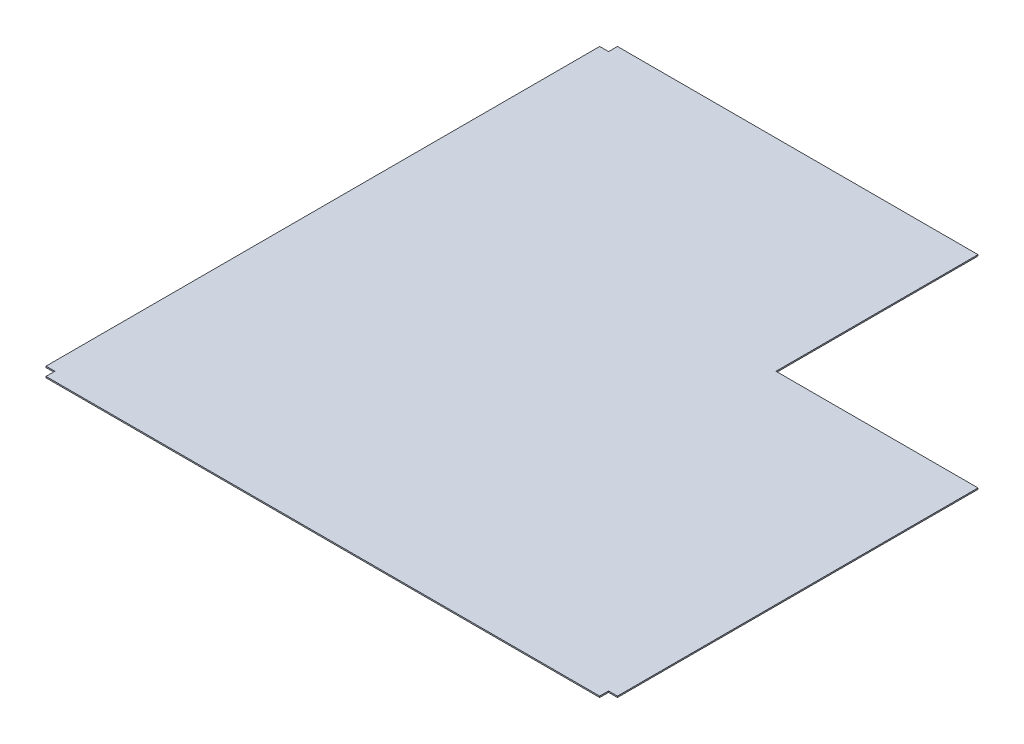
ISO-10303-21;
HEADER;
FILE_DESCRIPTION(('STEP AP214'),'2;1');
FILE_NAME('part.step','',(''),(''),'','','');
FILE_SCHEMA(('AUTOMOTIVE_DESIGN { 1 0 10303 214 1 1 1 1 }'));
ENDSEC;
DATA;
#1=APPLICATION_CONTEXT('core data for automotive mechanical design processes');
#2=APPLICATION_PROTOCOL_DEFINITION('international standard','automotive_design',2000,#1);
#3=PRODUCT_CONTEXT('',#1,'mechanical');
#4=PRODUCT('Part','Part','',(#3));
#5=PRODUCT_RELATED_PRODUCT_CATEGORY('part','',(#4));
#6=PRODUCT_DEFINITION_FORMATION('','',#4);
#7=PRODUCT_DEFINITION_CONTEXT('part definition',#1,'design');
#8=PRODUCT_DEFINITION('design','',#6,#7);
#9=PRODUCT_DEFINITION_SHAPE('','',#8);
#10=(LENGTH_UNIT() NAMED_UNIT(*) SI_UNIT(.MILLI.,.METRE.));
#11=(NAMED_UNIT(*) PLANE_ANGLE_UNIT() SI_UNIT($,.RADIAN.));
#12=(NAMED_UNIT(*) SI_UNIT($,.STERADIAN.) SOLID_ANGLE_UNIT());
#13=UNCERTAINTY_MEASURE_WITH_UNIT(LENGTH_MEASURE(1.E-05),#10,'distance_accuracy_value','');
#14=(GEOMETRIC_REPRESENTATION_CONTEXT(3) GLOBAL_UNCERTAINTY_ASSIGNED_CONTEXT((#13)) GLOBAL_UNIT_ASSIGNED_CONTEXT((#10,
#11,#12)) REPRESENTATION_CONTEXT('',''));
#15=CARTESIAN_POINT('',(0.,0.,0.));
#16=DIRECTION('',(0.,0.,1.));
#17=DIRECTION('',(1.,0.,0.));
#18=AXIS2_PLACEMENT_3D('',#15,#16,#17);
#19=CARTESIAN_POINT('',(280.,1.,0.));
#20=DIRECTION('',(0.,0.,1.));
#21=DIRECTION('',(1.,0.,0.));
#22=AXIS2_PLACEMENT_3D('',#19,#20,#21);
#23=PLANE('',#22);
#24=DIRECTION('',(-1.,0.,0.));
#25=VECTOR('',#24,1.);
#26=CARTESIAN_POINT('',(280.,0.,0.));
#27=LINE('',#26,#25);
#28=CARTESIAN_POINT('',(280.,0.,0.));
#29=VERTEX_POINT('',#28);
#30=CARTESIAN_POINT('',(0.,0.,0.));
#31=VERTEX_POINT('',#30);
#32=EDGE_CURVE('E157',#29,#31,#27,.T.);
#33=ORIENTED_EDGE('',*,*,#32,.T.);
#34=DIRECTION('',(0.,-1.,0.));
#35=VECTOR('',#34,1.);
#36=CARTESIAN_POINT('',(0.,1.,0.));
#37=LINE('',#36,#35);
#38=CARTESIAN_POINT('',(0.,1.,0.));
#39=VERTEX_POINT('',#38);
#40=EDGE_CURVE('E11',#39,#31,#37,.T.);
#41=ORIENTED_EDGE('',*,*,#40,.F.);
#42=DIRECTION('',(-1.,0.,0.));
#43=VECTOR('',#42,1.);
#44=CARTESIAN_POINT('',(280.,1.,0.));
#45=LINE('',#44,#43);
#46=CARTESIAN_POINT('',(280.,1.,0.));
#47=VERTEX_POINT('',#46);
#48=EDGE_CURVE('E179',#47,#39,#45,.T.);
#49=ORIENTED_EDGE('',*,*,#48,.F.);
#50=DIRECTION('',(0.,-1.,0.));
#51=VECTOR('',#50,1.);
#52=CARTESIAN_POINT('',(280.,1.,0.));
#53=LINE('',#52,#51);
#54=EDGE_CURVE('E153',#47,#29,#53,.T.);
#55=ORIENTED_EDGE('',*,*,#54,.T.);
#56=EDGE_LOOP('',(#33,#41,#49,#55));
#57=FACE_BOUND('',#56,.T.);
#58=ADVANCED_FACE('F37',(#57),#23,.F.);
#59=CARTESIAN_POINT('',(0.,1.,0.));
#60=DIRECTION('',(1.,0.,0.));
#61=DIRECTION('',(0.,0.,-1.));
#62=AXIS2_PLACEMENT_3D('',#59,#60,#61);
#63=PLANE('',#62);
#64=DIRECTION('',(0.,0.,1.));
#65=VECTOR('',#64,1.);
#66=CARTESIAN_POINT('',(0.,0.,0.));
#67=LINE('',#66,#65);
#68=CARTESIAN_POINT('',(0.,0.,6.9));
#69=VERTEX_POINT('',#68);
#70=EDGE_CURVE('E160',#31,#69,#67,.T.);
#71=ORIENTED_EDGE('',*,*,#70,.T.);
#72=DIRECTION('',(0.,-1.,0.));
#73=VECTOR('',#72,1.);
#74=CARTESIAN_POINT('',(0.,1.,6.9));
#75=LINE('',#74,#73);
#76=CARTESIAN_POINT('',(0.,1.,6.9));
#77=VERTEX_POINT('',#76);
#78=EDGE_CURVE('E45',#77,#69,#75,.T.);
#79=ORIENTED_EDGE('',*,*,#78,.F.);
#80=DIRECTION('',(0.,0.,1.));
#81=VECTOR('',#80,1.);
#82=CARTESIAN_POINT('',(0.,1.,0.));
#83=LINE('',#82,#81);
#84=EDGE_CURVE('E108',#39,#77,#83,.T.);
#85=ORIENTED_EDGE('',*,*,#84,.F.);
#86=ORIENTED_EDGE('',*,*,#40,.T.);
#87=EDGE_LOOP('',(#71,#79,#85,#86));
#88=FACE_BOUND('',#87,.T.);
#89=ADVANCED_FACE('F257',(#88),#63,.F.);
#90=CARTESIAN_POINT('',(0.,1.,6.9));
#91=DIRECTION('',(0.,0.,1.));
#92=DIRECTION('',(1.,0.,0.));
#93=AXIS2_PLACEMENT_3D('',#90,#91,#92);
#94=PLANE('',#93);
#95=DIRECTION('',(-1.,0.,0.));
#96=VECTOR('',#95,1.);
#97=CARTESIAN_POINT('',(0.,0.,6.9));
#98=LINE('',#97,#96);
#99=CARTESIAN_POINT('',(-6.9,0.,6.9));
#100=VERTEX_POINT('',#99);
#101=EDGE_CURVE('E162',#69,#100,#98,.T.);
#102=ORIENTED_EDGE('',*,*,#101,.T.);
#103=DIRECTION('',(0.,-1.,0.));
#104=VECTOR('',#103,1.);
#105=CARTESIAN_POINT('',(-6.9,1.,6.9));
#106=LINE('',#105,#104);
#107=CARTESIAN_POINT('',(-6.9,1.,6.9));
#108=VERTEX_POINT('',#107);
#109=EDGE_CURVE('E198',#108,#100,#106,.T.);
#110=ORIENTED_EDGE('',*,*,#109,.F.);
#111=DIRECTION('',(-1.,0.,0.));
#112=VECTOR('',#111,1.);
#113=CARTESIAN_POINT('',(0.,1.,6.9));
#114=LINE('',#113,#112);
#115=EDGE_CURVE('E206',#77,#108,#114,.T.);
#116=ORIENTED_EDGE('',*,*,#115,.F.);
#117=ORIENTED_EDGE('',*,*,#78,.T.);
#118=EDGE_LOOP('',(#102,#110,#116,#117));
#119=FACE_BOUND('',#118,.T.);
#120=ADVANCED_FACE('F204',(#119),#94,.F.);
#121=CARTESIAN_POINT('',(-6.9,1.,6.9));
#122=DIRECTION('',(1.,0.,0.));
#123=DIRECTION('',(0.,0.,-1.));
#124=AXIS2_PLACEMENT_3D('',#121,#122,#123);
#125=PLANE('',#124);
#126=DIRECTION('',(0.,0.,1.));
#127=VECTOR('',#126,1.);
#128=CARTESIAN_POINT('',(-6.9,0.,6.9));
#129=LINE('',#128,#127);
#130=CARTESIAN_POINT('',(-6.89999999999995,0.,436.9));
#131=VERTEX_POINT('',#130);
#132=EDGE_CURVE('E164',#100,#131,#129,.T.);
#133=ORIENTED_EDGE('',*,*,#132,.T.);
#134=DIRECTION('',(0.,-1.,0.));
#135=VECTOR('',#134,1.);
#136=CARTESIAN_POINT('',(-6.89999999999995,1.,436.9));
#137=LINE('',#136,#135);
#138=CARTESIAN_POINT('',(-6.89999999999995,1.,436.9));
#139=VERTEX_POINT('',#138);
#140=EDGE_CURVE('E195',#139,#131,#137,.T.);
#141=ORIENTED_EDGE('',*,*,#140,.F.);
#142=DIRECTION('',(0.,0.,1.));
#143=VECTOR('',#142,1.);
#144=CARTESIAN_POINT('',(-6.9,1.,6.9));
#145=LINE('',#144,#143);
#146=EDGE_CURVE('E224',#108,#139,#145,.T.);
#147=ORIENTED_EDGE('',*,*,#146,.F.);
#148=ORIENTED_EDGE('',*,*,#109,.T.);
#149=EDGE_LOOP('',(#133,#141,#147,#148));
#150=FACE_BOUND('',#149,.T.);
#151=ADVANCED_FACE('F215',(#150),#125,.F.);
#152=CARTESIAN_POINT('',(-6.89999999999995,1.,436.9));
#153=DIRECTION('',(0.,0.,-1.));
#154=DIRECTION('',(-1.,0.,0.));
#155=AXIS2_PLACEMENT_3D('',#152,#153,#154);
#156=PLANE('',#155);
#157=DIRECTION('',(1.,0.,0.));
#158=VECTOR('',#157,1.);
#159=CARTESIAN_POINT('',(-6.89999999999995,0.,436.9));
#160=LINE('',#159,#158);
#161=CARTESIAN_POINT('',(0.,0.,436.9));
#162=VERTEX_POINT('',#161);
#163=EDGE_CURVE('E166',#131,#162,#160,.T.);
#164=ORIENTED_EDGE('',*,*,#163,.T.);
#165=DIRECTION('',(0.,-1.,0.));
#166=VECTOR('',#165,1.);
#167=CARTESIAN_POINT('',(0.,1.,436.9));
#168=LINE('',#167,#166);
#169=CARTESIAN_POINT('',(0.,1.,436.9));
#170=VERTEX_POINT('',#169);
#171=EDGE_CURVE('E192',#170,#162,#168,.T.);
#172=ORIENTED_EDGE('',*,*,#171,.F.);
#173=DIRECTION('',(1.,0.,0.));
#174=VECTOR('',#173,1.);
#175=CARTESIAN_POINT('',(-6.89999999999995,1.,436.9));
#176=LINE('',#175,#174);
#177=EDGE_CURVE('E221',#139,#170,#176,.T.);
#178=ORIENTED_EDGE('',*,*,#177,.F.);
#179=ORIENTED_EDGE('',*,*,#140,.T.);
#180=EDGE_LOOP('',(#164,#172,#178,#179));
#181=FACE_BOUND('',#180,.T.);
#182=ADVANCED_FACE('F219',(#181),#156,.F.);
#183=CARTESIAN_POINT('',(0.,1.,436.9));
#184=DIRECTION('',(1.,0.,0.));
#185=DIRECTION('',(0.,0.,-1.));
#186=AXIS2_PLACEMENT_3D('',#183,#184,#185);
#187=PLANE('',#186);
#188=DIRECTION('',(0.,0.,1.));
#189=VECTOR('',#188,1.);
#190=CARTESIAN_POINT('',(0.,0.,436.9));
#191=LINE('',#190,#189);
#192=CARTESIAN_POINT('',(0.,0.,443.8));
#193=VERTEX_POINT('',#192);
#194=EDGE_CURVE('E168',#162,#193,#191,.T.);
#195=ORIENTED_EDGE('',*,*,#194,.T.);
#196=DIRECTION('',(0.,-1.,0.));
#197=VECTOR('',#196,1.);
#198=CARTESIAN_POINT('',(0.,1.,443.8));
#199=LINE('',#198,#197);
#200=CARTESIAN_POINT('',(0.,1.,443.8));
#201=VERTEX_POINT('',#200);
#202=EDGE_CURVE('E189',#201,#193,#199,.T.);
#203=ORIENTED_EDGE('',*,*,#202,.F.);
#204=DIRECTION('',(0.,0.,1.));
#205=VECTOR('',#204,1.);
#206=CARTESIAN_POINT('',(0.,1.,436.9));
#207=LINE('',#206,#205);
#208=EDGE_CURVE('E223',#170,#201,#207,.T.);
#209=ORIENTED_EDGE('',*,*,#208,.F.);
#210=ORIENTED_EDGE('',*,*,#171,.T.);
#211=EDGE_LOOP('',(#195,#203,#209,#210));
#212=FACE_BOUND('',#211,.T.);
#213=ADVANCED_FACE('F270',(#212),#187,.F.);
#214=CARTESIAN_POINT('',(0.,1.,443.8));
#215=DIRECTION('',(0.,0.,-1.));
#216=DIRECTION('',(-1.,0.,0.));
#217=AXIS2_PLACEMENT_3D('',#214,#215,#216);
#218=PLANE('',#217);
#219=DIRECTION('',(1.,0.,0.));
#220=VECTOR('',#219,1.);
#221=CARTESIAN_POINT('',(0.,0.,443.8));
#222=LINE('',#221,#220);
#223=CARTESIAN_POINT('',(430.,0.,443.8));
#224=VERTEX_POINT('',#223);
#225=EDGE_CURVE('E170',#193,#224,#222,.T.);
#226=ORIENTED_EDGE('',*,*,#225,.T.);
#227=DIRECTION('',(0.,-1.,0.));
#228=VECTOR('',#227,1.);
#229=CARTESIAN_POINT('',(430.,1.,443.8));
#230=LINE('',#229,#228);
#231=CARTESIAN_POINT('',(430.,1.,443.8));
#232=VERTEX_POINT('',#231);
#233=EDGE_CURVE('E186',#232,#224,#230,.T.);
#234=ORIENTED_EDGE('',*,*,#233,.F.);
#235=DIRECTION('',(1.,0.,0.));
#236=VECTOR('',#235,1.);
#237=CARTESIAN_POINT('',(0.,1.,443.8));
#238=LINE('',#237,#236);
#239=EDGE_CURVE('E226',#201,#232,#238,.T.);
#240=ORIENTED_EDGE('',*,*,#239,.F.);
#241=ORIENTED_EDGE('',*,*,#202,.T.);
#242=EDGE_LOOP('',(#226,#234,#240,#241));
#243=FACE_BOUND('',#242,.T.);
#244=ADVANCED_FACE('F273',(#243),#218,.F.);
#245=CARTESIAN_POINT('',(430.,1.,443.8));
#246=DIRECTION('',(-1.,0.,0.));
#247=DIRECTION('',(0.,0.,1.));
#248=AXIS2_PLACEMENT_3D('',#245,#246,#247);
#249=PLANE('',#248);
#250=DIRECTION('',(0.,0.,-1.));
#251=VECTOR('',#250,1.);
#252=CARTESIAN_POINT('',(430.,0.,443.8));
#253=LINE('',#252,#251);
#254=CARTESIAN_POINT('',(430.,0.,436.9));
#255=VERTEX_POINT('',#254);
#256=EDGE_CURVE('E172',#224,#255,#253,.T.);
#257=ORIENTED_EDGE('',*,*,#256,.T.);
#258=DIRECTION('',(0.,-1.,0.));
#259=VECTOR('',#258,1.);
#260=CARTESIAN_POINT('',(430.,1.,436.9));
#261=LINE('',#260,#259);
#262=CARTESIAN_POINT('',(430.,1.,436.9));
#263=VERTEX_POINT('',#262);
#264=EDGE_CURVE('E183',#263,#255,#261,.T.);
#265=ORIENTED_EDGE('',*,*,#264,.F.);
#266=DIRECTION('',(0.,0.,-1.));
#267=VECTOR('',#266,1.);
#268=CARTESIAN_POINT('',(430.,1.,443.8));
#269=LINE('',#268,#267);
#270=EDGE_CURVE('E232',#232,#263,#269,.T.);
#271=ORIENTED_EDGE('',*,*,#270,.F.);
#272=ORIENTED_EDGE('',*,*,#233,.T.);
#273=EDGE_LOOP('',(#257,#265,#271,#272));
#274=FACE_BOUND('',#273,.T.);
#275=ADVANCED_FACE('F238',(#274),#249,.F.);
#276=CARTESIAN_POINT('',(430.,1.,436.9));
#277=DIRECTION('',(0.,0.,-1.));
#278=DIRECTION('',(-1.,0.,0.));
#279=AXIS2_PLACEMENT_3D('',#276,#277,#278);
#280=PLANE('',#279);
#281=DIRECTION('',(1.,0.,0.));
#282=VECTOR('',#281,1.);
#283=CARTESIAN_POINT('',(430.,0.,436.9));
#284=LINE('',#283,#282);
#285=CARTESIAN_POINT('',(436.9,0.,436.9));
#286=VERTEX_POINT('',#285);
#287=EDGE_CURVE('E174',#255,#286,#284,.T.);
#288=ORIENTED_EDGE('',*,*,#287,.T.);
#289=DIRECTION('',(0.,-1.,0.));
#290=VECTOR('',#289,1.);
#291=CARTESIAN_POINT('',(436.9,1.,436.9));
#292=LINE('',#291,#290);
#293=CARTESIAN_POINT('',(436.9,1.,436.9));
#294=VERTEX_POINT('',#293);
#295=EDGE_CURVE('E148',#294,#286,#292,.T.);
#296=ORIENTED_EDGE('',*,*,#295,.F.);
#297=DIRECTION('',(1.,0.,0.));
#298=VECTOR('',#297,1.);
#299=CARTESIAN_POINT('',(430.,1.,436.9));
#300=LINE('',#299,#298);
#301=EDGE_CURVE('E139',#263,#294,#300,.T.);
#302=ORIENTED_EDGE('',*,*,#301,.F.);
#303=ORIENTED_EDGE('',*,*,#264,.T.);
#304=EDGE_LOOP('',(#288,#296,#302,#303));
#305=FACE_BOUND('',#304,.T.);
#306=ADVANCED_FACE('F242',(#305),#280,.F.);
#307=CARTESIAN_POINT('',(436.9,1.,436.9));
#308=DIRECTION('',(-1.,0.,0.));
#309=DIRECTION('',(0.,0.,1.));
#310=AXIS2_PLACEMENT_3D('',#307,#308,#309);
#311=PLANE('',#310);
#312=DIRECTION('',(0.,0.,-1.));
#313=VECTOR('',#312,1.);
#314=CARTESIAN_POINT('',(436.9,0.,436.9));
#315=LINE('',#314,#313);
#316=CARTESIAN_POINT('',(436.9,0.,156.9));
#317=VERTEX_POINT('',#316);
#318=EDGE_CURVE('E147',#286,#317,#315,.T.);
#319=ORIENTED_EDGE('',*,*,#318,.T.);
#320=DIRECTION('',(0.,-1.,0.));
#321=VECTOR('',#320,1.);
#322=CARTESIAN_POINT('',(436.9,1.,156.9));
#323=LINE('',#322,#321);
#324=CARTESIAN_POINT('',(436.9,1.,156.9));
#325=VERTEX_POINT('',#324);
#326=EDGE_CURVE('E144',#325,#317,#323,.T.);
#327=ORIENTED_EDGE('',*,*,#326,.F.);
#328=DIRECTION('',(0.,0.,-1.));
#329=VECTOR('',#328,1.);
#330=CARTESIAN_POINT('',(436.9,1.,436.9));
#331=LINE('',#330,#329);
#332=EDGE_CURVE('E133',#294,#325,#331,.T.);
#333=ORIENTED_EDGE('',*,*,#332,.F.);
#334=ORIENTED_EDGE('',*,*,#295,.T.);
#335=EDGE_LOOP('',(#319,#327,#333,#334));
#336=FACE_BOUND('',#335,.T.);
#337=ADVANCED_FACE('F145',(#336),#311,.F.);
#338=CARTESIAN_POINT('',(436.9,1.,156.9));
#339=DIRECTION('',(0.,0.,1.));
#340=DIRECTION('',(1.,0.,0.));
#341=AXIS2_PLACEMENT_3D('',#338,#339,#340);
#342=PLANE('',#341);
#343=DIRECTION('',(-1.,0.,0.));
#344=VECTOR('',#343,1.);
#345=CARTESIAN_POINT('',(436.9,0.,156.9));
#346=LINE('',#345,#344);
#347=CARTESIAN_POINT('',(280.,0.,156.9));
#348=VERTEX_POINT('',#347);
#349=EDGE_CURVE('E94',#317,#348,#346,.T.);
#350=ORIENTED_EDGE('',*,*,#349,.T.);
#351=DIRECTION('',(0.,-1.,0.));
#352=VECTOR('',#351,1.);
#353=CARTESIAN_POINT('',(280.,1.,156.9));
#354=LINE('',#353,#352);
#355=CARTESIAN_POINT('',(280.,1.,156.9));
#356=VERTEX_POINT('',#355);
#357=EDGE_CURVE('E149',#356,#348,#354,.T.);
#358=ORIENTED_EDGE('',*,*,#357,.F.);
#359=DIRECTION('',(-1.,0.,0.));
#360=VECTOR('',#359,1.);
#361=CARTESIAN_POINT('',(436.9,1.,156.9));
#362=LINE('',#361,#360);
#363=EDGE_CURVE('E137',#325,#356,#362,.T.);
#364=ORIENTED_EDGE('',*,*,#363,.F.);
#365=ORIENTED_EDGE('',*,*,#326,.T.);
#366=EDGE_LOOP('',(#350,#358,#364,#365));
#367=FACE_BOUND('',#366,.T.);
#368=ADVANCED_FACE('F151',(#367),#342,.F.);
#369=CARTESIAN_POINT('',(280.,1.,156.9));
#370=DIRECTION('',(-1.,0.,0.));
#371=DIRECTION('',(0.,0.,1.));
#372=AXIS2_PLACEMENT_3D('',#369,#370,#371);
#373=PLANE('',#372);
#374=DIRECTION('',(0.,0.,-1.));
#375=VECTOR('',#374,1.);
#376=CARTESIAN_POINT('',(280.,0.,156.9));
#377=LINE('',#376,#375);
#378=EDGE_CURVE('E100',#348,#29,#377,.T.);
#379=ORIENTED_EDGE('',*,*,#378,.T.);
#380=ORIENTED_EDGE('',*,*,#54,.F.);
#381=DIRECTION('',(0.,0.,-1.));
#382=VECTOR('',#381,1.);
#383=CARTESIAN_POINT('',(280.,1.,156.9));
#384=LINE('',#383,#382);
#385=EDGE_CURVE('E53',#356,#47,#384,.T.);
#386=ORIENTED_EDGE('',*,*,#385,.F.);
#387=ORIENTED_EDGE('',*,*,#357,.T.);
#388=EDGE_LOOP('',(#379,#380,#386,#387));
#389=FACE_BOUND('',#388,.T.);
#390=ADVANCED_FACE('F246',(#389),#373,.F.);
#391=CARTESIAN_POINT('',(0.,1.,0.));
#392=DIRECTION('',(0.,1.,0.));
#393=DIRECTION('',(0.,0.,1.));
#394=AXIS2_PLACEMENT_3D('',#391,#392,#393);
#395=PLANE('',#394);
#396=ORIENTED_EDGE('',*,*,#48,.T.);
#397=ORIENTED_EDGE('',*,*,#84,.T.);
#398=ORIENTED_EDGE('',*,*,#115,.T.);
#399=ORIENTED_EDGE('',*,*,#146,.T.);
#400=ORIENTED_EDGE('',*,*,#177,.T.);
#401=ORIENTED_EDGE('',*,*,#208,.T.);
#402=ORIENTED_EDGE('',*,*,#239,.T.);
#403=ORIENTED_EDGE('',*,*,#270,.T.);
#404=ORIENTED_EDGE('',*,*,#301,.T.);
#405=ORIENTED_EDGE('',*,*,#332,.T.);
#406=ORIENTED_EDGE('',*,*,#363,.T.);
#407=ORIENTED_EDGE('',*,*,#385,.T.);
#408=EDGE_LOOP('',(#396,#397,#398,#399,#400,#401,#402,#403,#404,#405,#406,#407));
#409=FACE_BOUND('',#408,.T.);
#410=ADVANCED_FACE('F135',(#409),#395,.T.);
#411=CARTESIAN_POINT('',(0.,0.,0.));
#412=DIRECTION('',(0.,1.,0.));
#413=DIRECTION('',(0.,0.,1.));
#414=AXIS2_PLACEMENT_3D('',#411,#412,#413);
#415=PLANE('',#414);
#416=ORIENTED_EDGE('',*,*,#32,.F.);
#417=ORIENTED_EDGE('',*,*,#378,.F.);
#418=ORIENTED_EDGE('',*,*,#349,.F.);
#419=ORIENTED_EDGE('',*,*,#318,.F.);
#420=ORIENTED_EDGE('',*,*,#287,.F.);
#421=ORIENTED_EDGE('',*,*,#256,.F.);
#422=ORIENTED_EDGE('',*,*,#225,.F.);
#423=ORIENTED_EDGE('',*,*,#194,.F.);
#424=ORIENTED_EDGE('',*,*,#163,.F.);
#425=ORIENTED_EDGE('',*,*,#132,.F.);
#426=ORIENTED_EDGE('',*,*,#101,.F.);
#427=ORIENTED_EDGE('',*,*,#70,.F.);
#428=EDGE_LOOP('',(#416,#417,#418,#419,#420,#421,#422,#423,#424,#425,#426,#427));
#429=FACE_BOUND('',#428,.T.);
#430=ADVANCED_FACE('F210',(#429),#415,.F.);
#431=CLOSED_SHELL('',(#58,#89,#120,#151,#182,#213,#244,#275,#306,#337,#368,#390,#410,#430));
#432=MANIFOLD_SOLID_BREP('B2',#431);
#433=ADVANCED_BREP_SHAPE_REPRESENTATION('',(#18,#432),#14);
#434=SHAPE_DEFINITION_REPRESENTATION(#9,#433);
ENDSEC;
END-ISO-10303-21;
